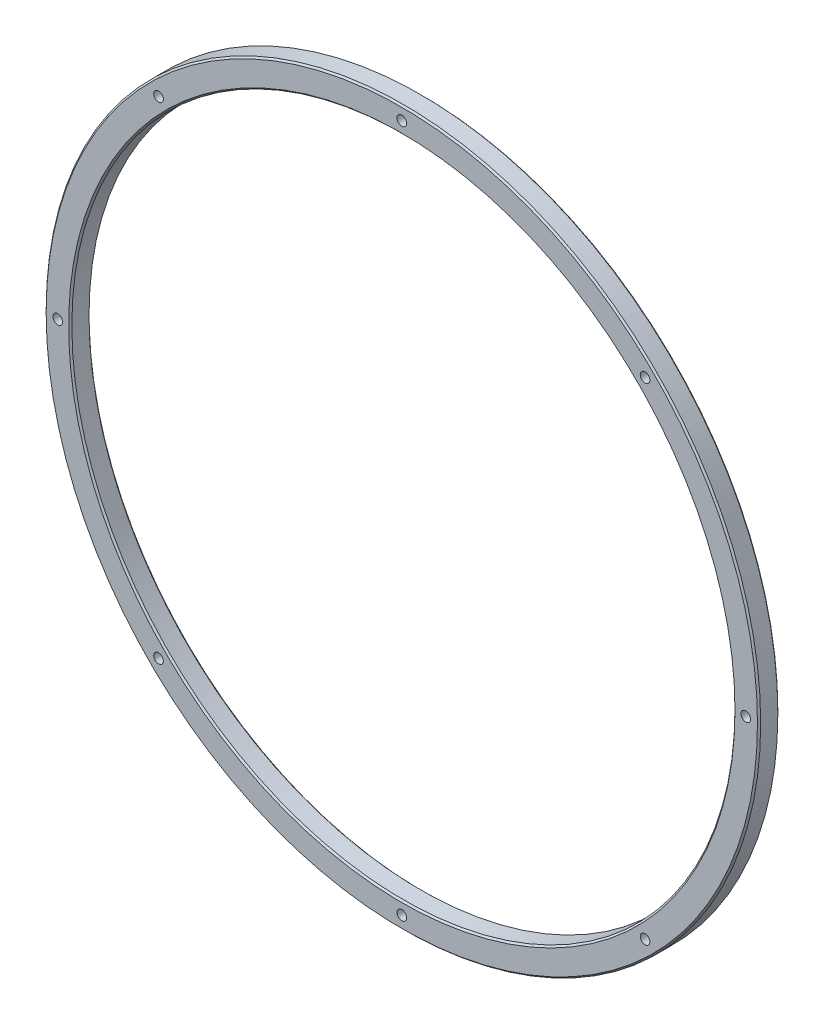
ISO-10303-21;
HEADER;
FILE_DESCRIPTION(('STEP AP214'),'2;1');
FILE_NAME('part.step','',(''),(''),'','','');
FILE_SCHEMA(('AUTOMOTIVE_DESIGN { 1 0 10303 214 1 1 1 1 }'));
ENDSEC;
DATA;
#1=APPLICATION_CONTEXT('core data for automotive mechanical design processes');
#2=APPLICATION_PROTOCOL_DEFINITION('international standard','automotive_design',2000,#1);
#3=PRODUCT_CONTEXT('',#1,'mechanical');
#4=PRODUCT('Part','Part','',(#3));
#5=PRODUCT_RELATED_PRODUCT_CATEGORY('part','',(#4));
#6=PRODUCT_DEFINITION_FORMATION('','',#4);
#7=PRODUCT_DEFINITION_CONTEXT('part definition',#1,'design');
#8=PRODUCT_DEFINITION('design','',#6,#7);
#9=PRODUCT_DEFINITION_SHAPE('','',#8);
#10=(LENGTH_UNIT() NAMED_UNIT(*) SI_UNIT(.MILLI.,.METRE.));
#11=(NAMED_UNIT(*) PLANE_ANGLE_UNIT() SI_UNIT($,.RADIAN.));
#12=(NAMED_UNIT(*) SI_UNIT($,.STERADIAN.) SOLID_ANGLE_UNIT());
#13=UNCERTAINTY_MEASURE_WITH_UNIT(LENGTH_MEASURE(1.E-05),#10,'distance_accuracy_value','');
#14=(GEOMETRIC_REPRESENTATION_CONTEXT(3) GLOBAL_UNCERTAINTY_ASSIGNED_CONTEXT((#13)) GLOBAL_UNIT_ASSIGNED_CONTEXT((#10,
#11,#12)) REPRESENTATION_CONTEXT('',''));
#15=CARTESIAN_POINT('',(0.,0.,0.));
#16=DIRECTION('',(0.,0.,1.));
#17=DIRECTION('',(1.,0.,0.));
#18=AXIS2_PLACEMENT_3D('',#15,#16,#17);
#19=CARTESIAN_POINT('',(0.,0.,6.35));
#20=DIRECTION('',(0.,0.,1.));
#21=DIRECTION('',(1.,0.,0.));
#22=AXIS2_PLACEMENT_3D('',#19,#20,#21);
#23=PLANE('',#22);
#24=CARTESIAN_POINT('',(0.,0.,6.35));
#25=DIRECTION('',(0.,0.,1.));
#26=DIRECTION('',(1.,0.,0.));
#27=AXIS2_PLACEMENT_3D('',#24,#25,#26);
#28=CIRCLE('',#27,103.75);
#29=CARTESIAN_POINT('',(103.75,0.,6.35));
#30=VERTEX_POINT('',#29);
#31=EDGE_CURVE('E156',#30,#30,#28,.F.);
#32=ORIENTED_EDGE('',*,*,#31,.T.);
#33=EDGE_LOOP('',(#32));
#34=FACE_BOUND('',#33,.T.);
#35=CARTESIAN_POINT('',(0.,0.,6.35));
#36=DIRECTION('',(0.,0.,1.));
#37=DIRECTION('',(1.,0.,0.));
#38=AXIS2_PLACEMENT_3D('',#35,#36,#37);
#39=CIRCLE('',#38,110.75);
#40=CARTESIAN_POINT('',(110.75,0.,6.35));
#41=VERTEX_POINT('',#40);
#42=EDGE_CURVE('E159',#41,#41,#39,.T.);
#43=ORIENTED_EDGE('',*,*,#42,.T.);
#44=EDGE_LOOP('',(#43));
#45=FACE_BOUND('',#44,.T.);
#46=CARTESIAN_POINT('',(-75.748813934608,75.7488139346098,6.35));
#47=DIRECTION('',(0.,0.,1.));
#48=DIRECTION('',(0.707106781186556,0.707106781186539,0.));
#49=AXIS2_PLACEMENT_3D('',#46,#47,#48);
#50=CIRCLE('',#49,1.49999999999999);
#51=CARTESIAN_POINT('',(-74.6881537628282,76.8094741063896,6.35));
#52=VERTEX_POINT('',#51);
#53=EDGE_CURVE('E210',#52,#52,#50,.T.);
#54=ORIENTED_EDGE('',*,*,#53,.F.);
#55=EDGE_LOOP('',(#54));
#56=FACE_BOUND('',#55,.T.);
#57=CARTESIAN_POINT('',(-107.125,1.12207481527071E-12,6.35));
#58=DIRECTION('',(0.,0.,1.));
#59=DIRECTION('',(0.,1.,0.));
#60=AXIS2_PLACEMENT_3D('',#57,#58,#59);
#61=CIRCLE('',#60,1.49999999999999);
#62=CARTESIAN_POINT('',(-107.125,1.50000000000111,6.35));
#63=VERTEX_POINT('',#62);
#64=EDGE_CURVE('E204',#63,#63,#61,.T.);
#65=ORIENTED_EDGE('',*,*,#64,.F.);
#66=EDGE_LOOP('',(#65));
#67=FACE_BOUND('',#66,.T.);
#68=CARTESIAN_POINT('',(-75.7488139346096,-75.7488139346082,6.35));
#69=DIRECTION('',(0.,0.,1.));
#70=DIRECTION('',(-0.707106781186541,0.707106781186554,0.));
#71=AXIS2_PLACEMENT_3D('',#68,#69,#70);
#72=CIRCLE('',#71,1.49999999999999);
#73=CARTESIAN_POINT('',(-76.8094741063894,-74.6881537628284,6.35));
#74=VERTEX_POINT('',#73);
#75=EDGE_CURVE('E198',#74,#74,#72,.T.);
#76=ORIENTED_EDGE('',*,*,#75,.F.);
#77=EDGE_LOOP('',(#76));
#78=FACE_BOUND('',#77,.T.);
#79=CARTESIAN_POINT('',(-7.48049876847141E-13,-107.125,6.35));
#80=DIRECTION('',(0.,0.,1.));
#81=DIRECTION('',(-1.,0.,0.));
#82=AXIS2_PLACEMENT_3D('',#79,#80,#81);
#83=CIRCLE('',#82,1.49999999999999);
#84=CARTESIAN_POINT('',(-1.50000000000074,-107.125,6.35));
#85=VERTEX_POINT('',#84);
#86=EDGE_CURVE('E192',#85,#85,#83,.T.);
#87=ORIENTED_EDGE('',*,*,#86,.F.);
#88=EDGE_LOOP('',(#87));
#89=FACE_BOUND('',#88,.T.);
#90=CARTESIAN_POINT('',(75.7488139346085,-75.7488139346093,6.35));
#91=DIRECTION('',(0.,0.,1.));
#92=DIRECTION('',(-0.707106781186551,-0.707106781186544,0.));
#93=AXIS2_PLACEMENT_3D('',#90,#91,#92);
#94=CIRCLE('',#93,1.49999999999999);
#95=CARTESIAN_POINT('',(74.6881537628287,-76.8094741063891,6.35));
#96=VERTEX_POINT('',#95);
#97=EDGE_CURVE('E186',#96,#96,#94,.T.);
#98=ORIENTED_EDGE('',*,*,#97,.F.);
#99=EDGE_LOOP('',(#98));
#100=FACE_BOUND('',#99,.T.);
#101=CARTESIAN_POINT('',(107.125,-3.74024938423571E-13,6.35));
#102=DIRECTION('',(0.,0.,1.));
#103=DIRECTION('',(0.,-1.,0.));
#104=AXIS2_PLACEMENT_3D('',#101,#102,#103);
#105=CIRCLE('',#104,1.49999999999999);
#106=CARTESIAN_POINT('',(107.125,-1.50000000000036,6.35));
#107=VERTEX_POINT('',#106);
#108=EDGE_CURVE('E180',#107,#107,#105,.T.);
#109=ORIENTED_EDGE('',*,*,#108,.F.);
#110=EDGE_LOOP('',(#109));
#111=FACE_BOUND('',#110,.T.);
#112=CARTESIAN_POINT('',(75.748813934609,75.7488139346088,6.35));
#113=DIRECTION('',(0.,0.,1.));
#114=DIRECTION('',(0.707106781186546,-0.707106781186549,0.));
#115=AXIS2_PLACEMENT_3D('',#112,#113,#114);
#116=CIRCLE('',#115,1.49999999999999);
#117=CARTESIAN_POINT('',(76.8094741063889,74.688153762829,6.35));
#118=VERTEX_POINT('',#117);
#119=EDGE_CURVE('E174',#118,#118,#116,.T.);
#120=ORIENTED_EDGE('',*,*,#119,.F.);
#121=EDGE_LOOP('',(#120));
#122=FACE_BOUND('',#121,.T.);
#123=CARTESIAN_POINT('',(0.,107.125,6.35));
#124=DIRECTION('',(0.,0.,1.));
#125=DIRECTION('',(1.,0.,0.));
#126=AXIS2_PLACEMENT_3D('',#123,#124,#125);
#127=CIRCLE('',#126,1.49999999999999);
#128=CARTESIAN_POINT('',(1.49999999999999,107.125,6.35));
#129=VERTEX_POINT('',#128);
#130=EDGE_CURVE('E171',#129,#129,#127,.T.);
#131=ORIENTED_EDGE('',*,*,#130,.F.);
#132=EDGE_LOOP('',(#131));
#133=FACE_BOUND('',#132,.T.);
#134=ADVANCED_FACE('F136',(#34,#45,#56,#67,#78,#89,#100,#111,#122,#133),#23,.T.);
#135=CARTESIAN_POINT('',(0.,0.,0.));
#136=DIRECTION('',(0.,0.,1.));
#137=DIRECTION('',(1.,0.,0.));
#138=AXIS2_PLACEMENT_3D('',#135,#136,#137);
#139=PLANE('',#138);
#140=CARTESIAN_POINT('',(0.,0.,0.));
#141=DIRECTION('',(0.,0.,1.));
#142=DIRECTION('',(1.,0.,0.));
#143=AXIS2_PLACEMENT_3D('',#140,#141,#142);
#144=CIRCLE('',#143,103.75);
#145=CARTESIAN_POINT('',(103.75,0.,0.));
#146=VERTEX_POINT('',#145);
#147=EDGE_CURVE('E11',#146,#146,#144,.T.);
#148=ORIENTED_EDGE('',*,*,#147,.T.);
#149=EDGE_LOOP('',(#148));
#150=FACE_BOUND('',#149,.T.);
#151=CARTESIAN_POINT('',(0.,0.,0.));
#152=DIRECTION('',(0.,0.,1.));
#153=DIRECTION('',(1.,0.,0.));
#154=AXIS2_PLACEMENT_3D('',#151,#152,#153);
#155=CIRCLE('',#154,110.75);
#156=CARTESIAN_POINT('',(110.75,0.,0.));
#157=VERTEX_POINT('',#156);
#158=EDGE_CURVE('E143',#157,#157,#155,.F.);
#159=ORIENTED_EDGE('',*,*,#158,.T.);
#160=EDGE_LOOP('',(#159));
#161=FACE_BOUND('',#160,.T.);
#162=CARTESIAN_POINT('',(-75.748813934608,75.7488139346098,0.));
#163=DIRECTION('',(0.,0.,1.));
#164=DIRECTION('',(0.707106781186556,0.707106781186539,0.));
#165=AXIS2_PLACEMENT_3D('',#162,#163,#164);
#166=CIRCLE('',#165,1.5);
#167=CARTESIAN_POINT('',(-74.6881537628282,76.8094741063896,0.));
#168=VERTEX_POINT('',#167);
#169=EDGE_CURVE('E213',#168,#168,#166,.T.);
#170=ORIENTED_EDGE('',*,*,#169,.T.);
#171=EDGE_LOOP('',(#170));
#172=FACE_BOUND('',#171,.T.);
#173=CARTESIAN_POINT('',(-107.125,1.12207481527071E-12,0.));
#174=DIRECTION('',(0.,0.,1.));
#175=DIRECTION('',(0.,1.,0.));
#176=AXIS2_PLACEMENT_3D('',#173,#174,#175);
#177=CIRCLE('',#176,1.5);
#178=CARTESIAN_POINT('',(-107.125,1.50000000000112,0.));
#179=VERTEX_POINT('',#178);
#180=EDGE_CURVE('E207',#179,#179,#177,.T.);
#181=ORIENTED_EDGE('',*,*,#180,.T.);
#182=EDGE_LOOP('',(#181));
#183=FACE_BOUND('',#182,.T.);
#184=CARTESIAN_POINT('',(-75.7488139346096,-75.7488139346082,0.));
#185=DIRECTION('',(0.,0.,1.));
#186=DIRECTION('',(-0.707106781186541,0.707106781186554,0.));
#187=AXIS2_PLACEMENT_3D('',#184,#185,#186);
#188=CIRCLE('',#187,1.5);
#189=CARTESIAN_POINT('',(-76.8094741063894,-74.6881537628284,0.));
#190=VERTEX_POINT('',#189);
#191=EDGE_CURVE('E201',#190,#190,#188,.T.);
#192=ORIENTED_EDGE('',*,*,#191,.T.);
#193=EDGE_LOOP('',(#192));
#194=FACE_BOUND('',#193,.T.);
#195=CARTESIAN_POINT('',(-7.48049876847141E-13,-107.125,0.));
#196=DIRECTION('',(0.,0.,1.));
#197=DIRECTION('',(-1.,0.,0.));
#198=AXIS2_PLACEMENT_3D('',#195,#196,#197);
#199=CIRCLE('',#198,1.5);
#200=CARTESIAN_POINT('',(-1.50000000000075,-107.125,0.));
#201=VERTEX_POINT('',#200);
#202=EDGE_CURVE('E195',#201,#201,#199,.T.);
#203=ORIENTED_EDGE('',*,*,#202,.T.);
#204=EDGE_LOOP('',(#203));
#205=FACE_BOUND('',#204,.T.);
#206=CARTESIAN_POINT('',(75.7488139346085,-75.7488139346093,0.));
#207=DIRECTION('',(0.,0.,1.));
#208=DIRECTION('',(-0.707106781186551,-0.707106781186544,0.));
#209=AXIS2_PLACEMENT_3D('',#206,#207,#208);
#210=CIRCLE('',#209,1.5);
#211=CARTESIAN_POINT('',(74.6881537628287,-76.8094741063891,0.));
#212=VERTEX_POINT('',#211);
#213=EDGE_CURVE('E189',#212,#212,#210,.T.);
#214=ORIENTED_EDGE('',*,*,#213,.T.);
#215=EDGE_LOOP('',(#214));
#216=FACE_BOUND('',#215,.T.);
#217=CARTESIAN_POINT('',(107.125,-3.74024938423571E-13,0.));
#218=DIRECTION('',(0.,0.,1.));
#219=DIRECTION('',(0.,-1.,0.));
#220=AXIS2_PLACEMENT_3D('',#217,#218,#219);
#221=CIRCLE('',#220,1.5);
#222=CARTESIAN_POINT('',(107.125,-1.50000000000037,0.));
#223=VERTEX_POINT('',#222);
#224=EDGE_CURVE('E183',#223,#223,#221,.T.);
#225=ORIENTED_EDGE('',*,*,#224,.T.);
#226=EDGE_LOOP('',(#225));
#227=FACE_BOUND('',#226,.T.);
#228=CARTESIAN_POINT('',(75.748813934609,75.7488139346088,0.));
#229=DIRECTION('',(0.,0.,1.));
#230=DIRECTION('',(0.707106781186546,-0.707106781186549,0.));
#231=AXIS2_PLACEMENT_3D('',#228,#229,#230);
#232=CIRCLE('',#231,1.5);
#233=CARTESIAN_POINT('',(76.8094741063889,74.688153762829,0.));
#234=VERTEX_POINT('',#233);
#235=EDGE_CURVE('E177',#234,#234,#232,.T.);
#236=ORIENTED_EDGE('',*,*,#235,.T.);
#237=EDGE_LOOP('',(#236));
#238=FACE_BOUND('',#237,.T.);
#239=CARTESIAN_POINT('',(0.,107.125,0.));
#240=DIRECTION('',(0.,0.,1.));
#241=DIRECTION('',(1.,0.,0.));
#242=AXIS2_PLACEMENT_3D('',#239,#240,#241);
#243=CIRCLE('',#242,1.5);
#244=CARTESIAN_POINT('',(1.5,107.125,0.));
#245=VERTEX_POINT('',#244);
#246=EDGE_CURVE('E168',#245,#245,#243,.T.);
#247=ORIENTED_EDGE('',*,*,#246,.T.);
#248=EDGE_LOOP('',(#247));
#249=FACE_BOUND('',#248,.T.);
#250=ADVANCED_FACE('F217',(#150,#161,#172,#183,#194,#205,#216,#227,#238,#249),#139,.F.);
#251=CARTESIAN_POINT('',(0.,0.,6.35));
#252=DIRECTION('',(0.,0.,-1.));
#253=DIRECTION('',(-1.,0.,0.));
#254=AXIS2_PLACEMENT_3D('',#251,#252,#253);
#255=CYLINDRICAL_SURFACE('',#254,111.25);
#256=CARTESIAN_POINT('',(0.,0.,5.85000000000004));
#257=DIRECTION('',(0.,0.,1.));
#258=DIRECTION('',(1.,0.,0.));
#259=AXIS2_PLACEMENT_3D('',#256,#257,#258);
#260=CIRCLE('',#259,111.25);
#261=CARTESIAN_POINT('',(111.25,0.,5.85000000000004));
#262=VERTEX_POINT('',#261);
#263=EDGE_CURVE('E147',#262,#262,#260,.F.);
#264=ORIENTED_EDGE('',*,*,#263,.T.);
#265=EDGE_LOOP('',(#264));
#266=FACE_BOUND('',#265,.T.);
#267=CARTESIAN_POINT('',(0.,0.,0.500000000000014));
#268=DIRECTION('',(0.,0.,1.));
#269=DIRECTION('',(1.,0.,0.));
#270=AXIS2_PLACEMENT_3D('',#267,#268,#269);
#271=CIRCLE('',#270,111.25);
#272=CARTESIAN_POINT('',(111.25,0.,0.500000000000014));
#273=VERTEX_POINT('',#272);
#274=EDGE_CURVE('E151',#273,#273,#271,.T.);
#275=ORIENTED_EDGE('',*,*,#274,.T.);
#276=EDGE_LOOP('',(#275));
#277=FACE_BOUND('',#276,.T.);
#278=ADVANCED_FACE('F259',(#266,#277),#255,.T.);
#279=CARTESIAN_POINT('',(0.,0.,6.35));
#280=DIRECTION('',(0.,0.,-1.));
#281=DIRECTION('',(-1.,0.,0.));
#282=AXIS2_PLACEMENT_3D('',#279,#280,#281);
#283=CYLINDRICAL_SURFACE('',#282,103.25);
#284=CARTESIAN_POINT('',(0.,0.,5.85));
#285=DIRECTION('',(0.,0.,1.));
#286=DIRECTION('',(1.,0.,0.));
#287=AXIS2_PLACEMENT_3D('',#284,#285,#286);
#288=CIRCLE('',#287,103.25);
#289=CARTESIAN_POINT('',(103.25,0.,5.85));
#290=VERTEX_POINT('',#289);
#291=EDGE_CURVE('E162',#290,#290,#288,.T.);
#292=ORIENTED_EDGE('',*,*,#291,.T.);
#293=EDGE_LOOP('',(#292));
#294=FACE_BOUND('',#293,.T.);
#295=CARTESIAN_POINT('',(0.,0.,0.500000000000014));
#296=DIRECTION('',(0.,0.,1.));
#297=DIRECTION('',(1.,0.,0.));
#298=AXIS2_PLACEMENT_3D('',#295,#296,#297);
#299=CIRCLE('',#298,103.25);
#300=CARTESIAN_POINT('',(103.25,0.,0.500000000000014));
#301=VERTEX_POINT('',#300);
#302=EDGE_CURVE('E165',#301,#301,#299,.F.);
#303=ORIENTED_EDGE('',*,*,#302,.T.);
#304=EDGE_LOOP('',(#303));
#305=FACE_BOUND('',#304,.T.);
#306=ADVANCED_FACE('F249',(#294,#305),#283,.F.);
#307=CARTESIAN_POINT('',(0.,107.125,6.35));
#308=DIRECTION('',(0.,0.,1.));
#309=DIRECTION('',(1.,0.,0.));
#310=AXIS2_PLACEMENT_3D('',#307,#308,#309);
#311=CYLINDRICAL_SURFACE('',#310,1.49999999999999);
#312=ORIENTED_EDGE('',*,*,#246,.F.);
#313=EDGE_LOOP('',(#312));
#314=FACE_BOUND('',#313,.T.);
#315=ORIENTED_EDGE('',*,*,#130,.T.);
#316=EDGE_LOOP('',(#315));
#317=FACE_BOUND('',#316,.T.);
#318=ADVANCED_FACE('F246',(#314,#317),#311,.F.);
#319=CARTESIAN_POINT('',(75.748813934609,75.7488139346088,6.35));
#320=DIRECTION('',(0.,0.,1.));
#321=DIRECTION('',(0.707106781186546,-0.707106781186549,0.));
#322=AXIS2_PLACEMENT_3D('',#319,#320,#321);
#323=CYLINDRICAL_SURFACE('',#322,1.49999999999999);
#324=ORIENTED_EDGE('',*,*,#235,.F.);
#325=EDGE_LOOP('',(#324));
#326=FACE_BOUND('',#325,.T.);
#327=ORIENTED_EDGE('',*,*,#119,.T.);
#328=EDGE_LOOP('',(#327));
#329=FACE_BOUND('',#328,.T.);
#330=ADVANCED_FACE('F248',(#326,#329),#323,.F.);
#331=CARTESIAN_POINT('',(107.125,-3.74024938423571E-13,6.35));
#332=DIRECTION('',(0.,0.,1.));
#333=DIRECTION('',(0.,-1.,0.));
#334=AXIS2_PLACEMENT_3D('',#331,#332,#333);
#335=CYLINDRICAL_SURFACE('',#334,1.49999999999999);
#336=ORIENTED_EDGE('',*,*,#224,.F.);
#337=EDGE_LOOP('',(#336));
#338=FACE_BOUND('',#337,.T.);
#339=ORIENTED_EDGE('',*,*,#108,.T.);
#340=EDGE_LOOP('',(#339));
#341=FACE_BOUND('',#340,.T.);
#342=ADVANCED_FACE('F256',(#338,#341),#335,.F.);
#343=CARTESIAN_POINT('',(75.7488139346085,-75.7488139346093,6.35));
#344=DIRECTION('',(0.,0.,1.));
#345=DIRECTION('',(-0.707106781186551,-0.707106781186544,0.));
#346=AXIS2_PLACEMENT_3D('',#343,#344,#345);
#347=CYLINDRICAL_SURFACE('',#346,1.49999999999999);
#348=ORIENTED_EDGE('',*,*,#213,.F.);
#349=EDGE_LOOP('',(#348));
#350=FACE_BOUND('',#349,.T.);
#351=ORIENTED_EDGE('',*,*,#97,.T.);
#352=EDGE_LOOP('',(#351));
#353=FACE_BOUND('',#352,.T.);
#354=ADVANCED_FACE('F375',(#350,#353),#347,.F.);
#355=CARTESIAN_POINT('',(-7.48049876847141E-13,-107.125,6.35));
#356=DIRECTION('',(0.,0.,1.));
#357=DIRECTION('',(-1.,0.,0.));
#358=AXIS2_PLACEMENT_3D('',#355,#356,#357);
#359=CYLINDRICAL_SURFACE('',#358,1.49999999999999);
#360=ORIENTED_EDGE('',*,*,#202,.F.);
#361=EDGE_LOOP('',(#360));
#362=FACE_BOUND('',#361,.T.);
#363=ORIENTED_EDGE('',*,*,#86,.T.);
#364=EDGE_LOOP('',(#363));
#365=FACE_BOUND('',#364,.T.);
#366=ADVANCED_FACE('F364',(#362,#365),#359,.F.);
#367=CARTESIAN_POINT('',(-75.7488139346096,-75.7488139346082,6.35));
#368=DIRECTION('',(0.,0.,1.));
#369=DIRECTION('',(-0.707106781186541,0.707106781186554,0.));
#370=AXIS2_PLACEMENT_3D('',#367,#368,#369);
#371=CYLINDRICAL_SURFACE('',#370,1.49999999999999);
#372=ORIENTED_EDGE('',*,*,#191,.F.);
#373=EDGE_LOOP('',(#372));
#374=FACE_BOUND('',#373,.T.);
#375=ORIENTED_EDGE('',*,*,#75,.T.);
#376=EDGE_LOOP('',(#375));
#377=FACE_BOUND('',#376,.T.);
#378=ADVANCED_FACE('F352',(#374,#377),#371,.F.);
#379=CARTESIAN_POINT('',(-107.125,1.12207481527071E-12,6.35));
#380=DIRECTION('',(0.,0.,1.));
#381=DIRECTION('',(0.,1.,0.));
#382=AXIS2_PLACEMENT_3D('',#379,#380,#381);
#383=CYLINDRICAL_SURFACE('',#382,1.49999999999999);
#384=ORIENTED_EDGE('',*,*,#180,.F.);
#385=EDGE_LOOP('',(#384));
#386=FACE_BOUND('',#385,.T.);
#387=ORIENTED_EDGE('',*,*,#64,.T.);
#388=EDGE_LOOP('',(#387));
#389=FACE_BOUND('',#388,.T.);
#390=ADVANCED_FACE('F224',(#386,#389),#383,.F.);
#391=CARTESIAN_POINT('',(-75.748813934608,75.7488139346098,6.35));
#392=DIRECTION('',(0.,0.,1.));
#393=DIRECTION('',(0.707106781186556,0.707106781186539,0.));
#394=AXIS2_PLACEMENT_3D('',#391,#392,#393);
#395=CYLINDRICAL_SURFACE('',#394,1.49999999999999);
#396=ORIENTED_EDGE('',*,*,#169,.F.);
#397=EDGE_LOOP('',(#396));
#398=FACE_BOUND('',#397,.T.);
#399=ORIENTED_EDGE('',*,*,#53,.T.);
#400=EDGE_LOOP('',(#399));
#401=FACE_BOUND('',#400,.T.);
#402=ADVANCED_FACE('F220',(#398,#401),#395,.F.);
#403=CARTESIAN_POINT('',(0.,0.,5.85));
#404=DIRECTION('',(0.,0.,1.));
#405=DIRECTION('',(1.,0.,0.));
#406=AXIS2_PLACEMENT_3D('',#403,#404,#405);
#407=CONICAL_SURFACE('',#406,103.25,0.785398163397448);
#408=ORIENTED_EDGE('',*,*,#31,.F.);
#409=EDGE_LOOP('',(#408));
#410=FACE_BOUND('',#409,.T.);
#411=ORIENTED_EDGE('',*,*,#291,.F.);
#412=EDGE_LOOP('',(#411));
#413=FACE_BOUND('',#412,.T.);
#414=ADVANCED_FACE('F223',(#410,#413),#407,.F.);
#415=CARTESIAN_POINT('',(0.,0.,6.35));
#416=DIRECTION('',(0.,0.,-1.));
#417=DIRECTION('',(-1.,0.,0.));
#418=AXIS2_PLACEMENT_3D('',#415,#416,#417);
#419=CONICAL_SURFACE('',#418,110.75,0.785398163397462);
#420=ORIENTED_EDGE('',*,*,#263,.F.);
#421=EDGE_LOOP('',(#420));
#422=FACE_BOUND('',#421,.T.);
#423=ORIENTED_EDGE('',*,*,#42,.F.);
#424=EDGE_LOOP('',(#423));
#425=FACE_BOUND('',#424,.T.);
#426=ADVANCED_FACE('F272',(#422,#425),#419,.T.);
#427=CARTESIAN_POINT('',(0.,0.,0.));
#428=DIRECTION('',(0.,0.,-1.));
#429=DIRECTION('',(-1.,0.,0.));
#430=AXIS2_PLACEMENT_3D('',#427,#428,#429);
#431=CONICAL_SURFACE('',#430,103.75,0.785398163397421);
#432=ORIENTED_EDGE('',*,*,#302,.F.);
#433=EDGE_LOOP('',(#432));
#434=FACE_BOUND('',#433,.T.);
#435=ORIENTED_EDGE('',*,*,#147,.F.);
#436=EDGE_LOOP('',(#435));
#437=FACE_BOUND('',#436,.T.);
#438=ADVANCED_FACE('F275',(#434,#437),#431,.F.);
#439=CARTESIAN_POINT('',(0.,0.,0.500000000000014));
#440=DIRECTION('',(0.,0.,1.));
#441=DIRECTION('',(1.,0.,0.));
#442=AXIS2_PLACEMENT_3D('',#439,#440,#441);
#443=CONICAL_SURFACE('',#442,111.25,0.785398163397435);
#444=ORIENTED_EDGE('',*,*,#158,.F.);
#445=EDGE_LOOP('',(#444));
#446=FACE_BOUND('',#445,.T.);
#447=ORIENTED_EDGE('',*,*,#274,.F.);
#448=EDGE_LOOP('',(#447));
#449=FACE_BOUND('',#448,.T.);
#450=ADVANCED_FACE('F138',(#446,#449),#443,.T.);
#451=CLOSED_SHELL('',(#134,#250,#278,#306,#318,#330,#342,#354,#366,#378,#390,#402,#414,#426,
#438,#450));
#452=MANIFOLD_SOLID_BREP('B2',#451);
#453=ADVANCED_BREP_SHAPE_REPRESENTATION('',(#18,#452),#14);
#454=SHAPE_DEFINITION_REPRESENTATION(#9,#453);
ENDSEC;
END-ISO-10303-21;
